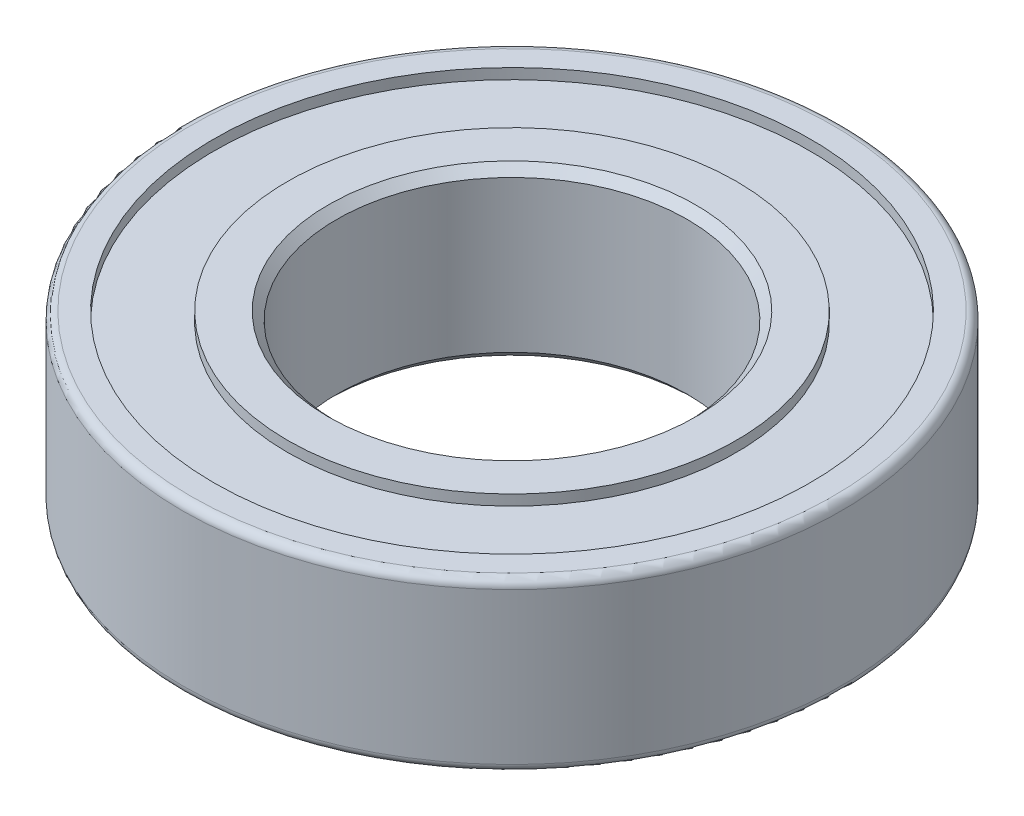
ISO-10303-21;
HEADER;
FILE_DESCRIPTION(('STEP AP214'),'2;1');
FILE_NAME('part.step','',(''),(''),'','','');
FILE_SCHEMA(('AUTOMOTIVE_DESIGN { 1 0 10303 214 1 1 1 1 }'));
ENDSEC;
DATA;
#1=APPLICATION_CONTEXT('core data for automotive mechanical design processes');
#2=APPLICATION_PROTOCOL_DEFINITION('international standard','automotive_design',2000,#1);
#3=PRODUCT_CONTEXT('',#1,'mechanical');
#4=PRODUCT('Part','Part','',(#3));
#5=PRODUCT_RELATED_PRODUCT_CATEGORY('part','',(#4));
#6=PRODUCT_DEFINITION_FORMATION('','',#4);
#7=PRODUCT_DEFINITION_CONTEXT('part definition',#1,'design');
#8=PRODUCT_DEFINITION('design','',#6,#7);
#9=PRODUCT_DEFINITION_SHAPE('','',#8);
#10=(LENGTH_UNIT() NAMED_UNIT(*) SI_UNIT(.MILLI.,.METRE.));
#11=(NAMED_UNIT(*) PLANE_ANGLE_UNIT() SI_UNIT($,.RADIAN.));
#12=(NAMED_UNIT(*) SI_UNIT($,.STERADIAN.) SOLID_ANGLE_UNIT());
#13=UNCERTAINTY_MEASURE_WITH_UNIT(LENGTH_MEASURE(1.E-05),#10,'distance_accuracy_value','');
#14=(GEOMETRIC_REPRESENTATION_CONTEXT(3) GLOBAL_UNCERTAINTY_ASSIGNED_CONTEXT((#13)) GLOBAL_UNIT_ASSIGNED_CONTEXT((#10,
#11,#12)) REPRESENTATION_CONTEXT('',''));
#15=CARTESIAN_POINT('',(0.,0.,0.));
#16=DIRECTION('',(0.,0.,1.));
#17=DIRECTION('',(1.,0.,0.));
#18=AXIS2_PLACEMENT_3D('',#15,#16,#17);
#19=CARTESIAN_POINT('',(0.,-5.4,0.));
#20=DIRECTION('',(0.,1.,0.));
#21=DIRECTION('',(0.,0.,1.));
#22=AXIS2_PLACEMENT_3D('',#19,#20,#21);
#23=TOROIDAL_SURFACE('',#22,22.9,0.6);
#24=CARTESIAN_POINT('',(0.,-6.00000000000001,0.));
#25=DIRECTION('',(0.,1.,0.));
#26=DIRECTION('',(0.,0.,1.));
#27=AXIS2_PLACEMENT_3D('',#24,#25,#26);
#28=CIRCLE('',#27,22.9);
#29=CARTESIAN_POINT('',(0.,-6.,22.9));
#30=VERTEX_POINT('',#29);
#31=EDGE_CURVE('E10',#30,#30,#28,.T.);
#32=ORIENTED_EDGE('',*,*,#31,.T.);
#33=EDGE_LOOP('',(#32));
#34=FACE_BOUND('',#33,.T.);
#35=CARTESIAN_POINT('',(0.,-5.4,0.));
#36=DIRECTION('',(0.,1.,0.));
#37=DIRECTION('',(0.,0.,1.));
#38=AXIS2_PLACEMENT_3D('',#35,#36,#37);
#39=CIRCLE('',#38,23.5);
#40=CARTESIAN_POINT('',(0.,-5.4,23.5));
#41=VERTEX_POINT('',#40);
#42=EDGE_CURVE('E100',#41,#41,#39,.T.);
#43=ORIENTED_EDGE('',*,*,#42,.F.);
#44=EDGE_LOOP('',(#43));
#45=FACE_BOUND('',#44,.T.);
#46=ADVANCED_FACE('F32',(#34,#45),#23,.T.);
#47=CARTESIAN_POINT('',(0.,-6.,22.9));
#48=DIRECTION('',(0.,-1.,0.));
#49=DIRECTION('',(0.,0.,-1.));
#50=AXIS2_PLACEMENT_3D('',#47,#48,#49);
#51=PLANE('',#50);
#52=CARTESIAN_POINT('',(0.,-6.00000000000001,0.));
#53=DIRECTION('',(0.,1.,0.));
#54=DIRECTION('',(0.,0.,1.));
#55=AXIS2_PLACEMENT_3D('',#52,#53,#54);
#56=CIRCLE('',#55,21.25);
#57=CARTESIAN_POINT('',(0.,-6.,21.25));
#58=VERTEX_POINT('',#57);
#59=EDGE_CURVE('E39',#58,#58,#56,.T.);
#60=ORIENTED_EDGE('',*,*,#59,.T.);
#61=EDGE_LOOP('',(#60));
#62=FACE_BOUND('',#61,.T.);
#63=ORIENTED_EDGE('',*,*,#31,.F.);
#64=EDGE_LOOP('',(#63));
#65=FACE_BOUND('',#64,.T.);
#66=ADVANCED_FACE('F108',(#62,#65),#51,.T.);
#67=CARTESIAN_POINT('',(0.,26.6806657171623,0.));
#68=DIRECTION('',(0.,1.,0.));
#69=DIRECTION('',(0.,0.,1.));
#70=AXIS2_PLACEMENT_3D('',#67,#68,#69);
#71=CYLINDRICAL_SURFACE('',#70,21.25);
#72=CARTESIAN_POINT('',(0.,-5.25,0.));
#73=DIRECTION('',(0.,1.,0.));
#74=DIRECTION('',(0.,0.,1.));
#75=AXIS2_PLACEMENT_3D('',#72,#73,#74);
#76=CIRCLE('',#75,21.25);
#77=CARTESIAN_POINT('',(0.,-5.25,21.25));
#78=VERTEX_POINT('',#77);
#79=EDGE_CURVE('E46',#78,#78,#76,.T.);
#80=ORIENTED_EDGE('',*,*,#79,.T.);
#81=EDGE_LOOP('',(#80));
#82=FACE_BOUND('',#81,.T.);
#83=ORIENTED_EDGE('',*,*,#59,.F.);
#84=EDGE_LOOP('',(#83));
#85=FACE_BOUND('',#84,.T.);
#86=ADVANCED_FACE('F112',(#82,#85),#71,.F.);
#87=CARTESIAN_POINT('',(0.,-5.25,21.25));
#88=DIRECTION('',(0.,-1.,0.));
#89=DIRECTION('',(0.,0.,-1.));
#90=AXIS2_PLACEMENT_3D('',#87,#88,#89);
#91=PLANE('',#90);
#92=CARTESIAN_POINT('',(0.,-5.25,0.));
#93=DIRECTION('',(0.,1.,0.));
#94=DIRECTION('',(0.,0.,1.));
#95=AXIS2_PLACEMENT_3D('',#92,#93,#94);
#96=CIRCLE('',#95,16.);
#97=CARTESIAN_POINT('',(0.,-5.25,16.));
#98=VERTEX_POINT('',#97);
#99=EDGE_CURVE('E53',#98,#98,#96,.T.);
#100=ORIENTED_EDGE('',*,*,#99,.T.);
#101=EDGE_LOOP('',(#100));
#102=FACE_BOUND('',#101,.T.);
#103=ORIENTED_EDGE('',*,*,#79,.F.);
#104=EDGE_LOOP('',(#103));
#105=FACE_BOUND('',#104,.T.);
#106=ADVANCED_FACE('F116',(#102,#105),#91,.T.);
#107=CARTESIAN_POINT('',(0.,26.6806657171623,0.));
#108=DIRECTION('',(0.,1.,0.));
#109=DIRECTION('',(0.,0.,1.));
#110=AXIS2_PLACEMENT_3D('',#107,#108,#109);
#111=CYLINDRICAL_SURFACE('',#110,16.);
#112=CARTESIAN_POINT('',(0.,-6.,0.));
#113=DIRECTION('',(0.,1.,0.));
#114=DIRECTION('',(0.,0.,1.));
#115=AXIS2_PLACEMENT_3D('',#112,#113,#114);
#116=CIRCLE('',#115,16.);
#117=CARTESIAN_POINT('',(0.,-6.,16.));
#118=VERTEX_POINT('',#117);
#119=EDGE_CURVE('E59',#118,#118,#116,.T.);
#120=ORIENTED_EDGE('',*,*,#119,.T.);
#121=EDGE_LOOP('',(#120));
#122=FACE_BOUND('',#121,.T.);
#123=ORIENTED_EDGE('',*,*,#99,.F.);
#124=EDGE_LOOP('',(#123));
#125=FACE_BOUND('',#124,.T.);
#126=ADVANCED_FACE('F123',(#122,#125),#111,.T.);
#127=CARTESIAN_POINT('',(0.,-6.,16.));
#128=DIRECTION('',(0.,-1.,0.));
#129=DIRECTION('',(0.,0.,-1.));
#130=AXIS2_PLACEMENT_3D('',#127,#128,#129);
#131=PLANE('',#130);
#132=CARTESIAN_POINT('',(0.,-6.00000000000001,0.));
#133=DIRECTION('',(0.,1.,0.));
#134=DIRECTION('',(0.,0.,1.));
#135=AXIS2_PLACEMENT_3D('',#132,#133,#134);
#136=CIRCLE('',#135,13.1);
#137=CARTESIAN_POINT('',(0.,-6.,13.1));
#138=VERTEX_POINT('',#137);
#139=EDGE_CURVE('E63',#138,#138,#136,.T.);
#140=ORIENTED_EDGE('',*,*,#139,.T.);
#141=EDGE_LOOP('',(#140));
#142=FACE_BOUND('',#141,.T.);
#143=ORIENTED_EDGE('',*,*,#119,.F.);
#144=EDGE_LOOP('',(#143));
#145=FACE_BOUND('',#144,.T.);
#146=ADVANCED_FACE('F127',(#142,#145),#131,.T.);
#147=CARTESIAN_POINT('',(0.,-6.00000000000001,0.));
#148=DIRECTION('',(0.,-1.,0.));
#149=DIRECTION('',(0.,0.,-1.));
#150=AXIS2_PLACEMENT_3D('',#147,#148,#149);
#151=CONICAL_SURFACE('',#150,13.1,0.785398163397447);
#152=CARTESIAN_POINT('',(0.,-5.4,0.));
#153=DIRECTION('',(0.,1.,0.));
#154=DIRECTION('',(0.,0.,1.));
#155=AXIS2_PLACEMENT_3D('',#152,#153,#154);
#156=CIRCLE('',#155,12.5);
#157=CARTESIAN_POINT('',(0.,-5.4,12.5));
#158=VERTEX_POINT('',#157);
#159=EDGE_CURVE('E67',#158,#158,#156,.T.);
#160=ORIENTED_EDGE('',*,*,#159,.T.);
#161=EDGE_LOOP('',(#160));
#162=FACE_BOUND('',#161,.T.);
#163=ORIENTED_EDGE('',*,*,#139,.F.);
#164=EDGE_LOOP('',(#163));
#165=FACE_BOUND('',#164,.T.);
#166=ADVANCED_FACE('F131',(#162,#165),#151,.F.);
#167=CARTESIAN_POINT('',(0.,26.6806657171623,0.));
#168=DIRECTION('',(0.,1.,0.));
#169=DIRECTION('',(0.,0.,1.));
#170=AXIS2_PLACEMENT_3D('',#167,#168,#169);
#171=CYLINDRICAL_SURFACE('',#170,12.5);
#172=CARTESIAN_POINT('',(0.,5.4,0.));
#173=DIRECTION('',(0.,1.,0.));
#174=DIRECTION('',(0.,0.,1.));
#175=AXIS2_PLACEMENT_3D('',#172,#173,#174);
#176=CIRCLE('',#175,12.5);
#177=CARTESIAN_POINT('',(0.,5.4,12.5));
#178=VERTEX_POINT('',#177);
#179=EDGE_CURVE('E71',#178,#178,#176,.T.);
#180=ORIENTED_EDGE('',*,*,#179,.T.);
#181=EDGE_LOOP('',(#180));
#182=FACE_BOUND('',#181,.T.);
#183=ORIENTED_EDGE('',*,*,#159,.F.);
#184=EDGE_LOOP('',(#183));
#185=FACE_BOUND('',#184,.T.);
#186=ADVANCED_FACE('F135',(#182,#185),#171,.F.);
#187=CARTESIAN_POINT('',(0.,5.4,0.));
#188=DIRECTION('',(0.,1.,0.));
#189=DIRECTION('',(0.,0.,1.));
#190=AXIS2_PLACEMENT_3D('',#187,#188,#189);
#191=CONICAL_SURFACE('',#190,12.5,0.785398163397451);
#192=CARTESIAN_POINT('',(0.,5.99999999999999,0.));
#193=DIRECTION('',(0.,1.,0.));
#194=DIRECTION('',(0.,0.,1.));
#195=AXIS2_PLACEMENT_3D('',#192,#193,#194);
#196=CIRCLE('',#195,13.1);
#197=CARTESIAN_POINT('',(0.,6.,13.1));
#198=VERTEX_POINT('',#197);
#199=EDGE_CURVE('E75',#198,#198,#196,.T.);
#200=ORIENTED_EDGE('',*,*,#199,.T.);
#201=EDGE_LOOP('',(#200));
#202=FACE_BOUND('',#201,.T.);
#203=ORIENTED_EDGE('',*,*,#179,.F.);
#204=EDGE_LOOP('',(#203));
#205=FACE_BOUND('',#204,.T.);
#206=ADVANCED_FACE('F139',(#202,#205),#191,.F.);
#207=CARTESIAN_POINT('',(0.,6.,16.));
#208=DIRECTION('',(0.,1.,0.));
#209=DIRECTION('',(0.,0.,1.));
#210=AXIS2_PLACEMENT_3D('',#207,#208,#209);
#211=PLANE('',#210);
#212=CARTESIAN_POINT('',(0.,5.99999999999999,0.));
#213=DIRECTION('',(0.,1.,0.));
#214=DIRECTION('',(0.,0.,1.));
#215=AXIS2_PLACEMENT_3D('',#212,#213,#214);
#216=CIRCLE('',#215,16.);
#217=CARTESIAN_POINT('',(0.,6.,16.));
#218=VERTEX_POINT('',#217);
#219=EDGE_CURVE('E79',#218,#218,#216,.T.);
#220=ORIENTED_EDGE('',*,*,#219,.T.);
#221=EDGE_LOOP('',(#220));
#222=FACE_BOUND('',#221,.T.);
#223=ORIENTED_EDGE('',*,*,#199,.F.);
#224=EDGE_LOOP('',(#223));
#225=FACE_BOUND('',#224,.T.);
#226=ADVANCED_FACE('F143',(#222,#225),#211,.T.);
#227=CARTESIAN_POINT('',(0.,26.6806657171623,0.));
#228=DIRECTION('',(0.,1.,0.));
#229=DIRECTION('',(0.,0.,1.));
#230=AXIS2_PLACEMENT_3D('',#227,#228,#229);
#231=CYLINDRICAL_SURFACE('',#230,16.);
#232=CARTESIAN_POINT('',(0.,5.24999999999999,0.));
#233=DIRECTION('',(0.,1.,0.));
#234=DIRECTION('',(0.,0.,1.));
#235=AXIS2_PLACEMENT_3D('',#232,#233,#234);
#236=CIRCLE('',#235,16.);
#237=CARTESIAN_POINT('',(0.,5.25,16.));
#238=VERTEX_POINT('',#237);
#239=EDGE_CURVE('E83',#238,#238,#236,.T.);
#240=ORIENTED_EDGE('',*,*,#239,.T.);
#241=EDGE_LOOP('',(#240));
#242=FACE_BOUND('',#241,.T.);
#243=ORIENTED_EDGE('',*,*,#219,.F.);
#244=EDGE_LOOP('',(#243));
#245=FACE_BOUND('',#244,.T.);
#246=ADVANCED_FACE('F147',(#242,#245),#231,.T.);
#247=CARTESIAN_POINT('',(0.,5.25,21.25));
#248=DIRECTION('',(0.,1.,0.));
#249=DIRECTION('',(0.,0.,1.));
#250=AXIS2_PLACEMENT_3D('',#247,#248,#249);
#251=PLANE('',#250);
#252=CARTESIAN_POINT('',(0.,5.24999999999999,0.));
#253=DIRECTION('',(0.,1.,0.));
#254=DIRECTION('',(0.,0.,1.));
#255=AXIS2_PLACEMENT_3D('',#252,#253,#254);
#256=CIRCLE('',#255,21.25);
#257=CARTESIAN_POINT('',(0.,5.25,21.25));
#258=VERTEX_POINT('',#257);
#259=EDGE_CURVE('E86',#258,#258,#256,.T.);
#260=ORIENTED_EDGE('',*,*,#259,.T.);
#261=EDGE_LOOP('',(#260));
#262=FACE_BOUND('',#261,.T.);
#263=ORIENTED_EDGE('',*,*,#239,.F.);
#264=EDGE_LOOP('',(#263));
#265=FACE_BOUND('',#264,.T.);
#266=ADVANCED_FACE('F151',(#262,#265),#251,.T.);
#267=CARTESIAN_POINT('',(0.,26.6806657171623,0.));
#268=DIRECTION('',(0.,1.,0.));
#269=DIRECTION('',(0.,0.,1.));
#270=AXIS2_PLACEMENT_3D('',#267,#268,#269);
#271=CYLINDRICAL_SURFACE('',#270,21.25);
#272=CARTESIAN_POINT('',(0.,5.99999999999999,0.));
#273=DIRECTION('',(0.,1.,0.));
#274=DIRECTION('',(0.,0.,1.));
#275=AXIS2_PLACEMENT_3D('',#272,#273,#274);
#276=CIRCLE('',#275,21.25);
#277=CARTESIAN_POINT('',(0.,6.,21.25));
#278=VERTEX_POINT('',#277);
#279=EDGE_CURVE('E90',#278,#278,#276,.T.);
#280=ORIENTED_EDGE('',*,*,#279,.T.);
#281=EDGE_LOOP('',(#280));
#282=FACE_BOUND('',#281,.T.);
#283=ORIENTED_EDGE('',*,*,#259,.F.);
#284=EDGE_LOOP('',(#283));
#285=FACE_BOUND('',#284,.T.);
#286=ADVANCED_FACE('F155',(#282,#285),#271,.F.);
#287=CARTESIAN_POINT('',(0.,6.,22.9));
#288=DIRECTION('',(0.,1.,0.));
#289=DIRECTION('',(0.,0.,1.));
#290=AXIS2_PLACEMENT_3D('',#287,#288,#289);
#291=PLANE('',#290);
#292=CARTESIAN_POINT('',(0.,5.99999999999999,0.));
#293=DIRECTION('',(0.,1.,0.));
#294=DIRECTION('',(0.,0.,1.));
#295=AXIS2_PLACEMENT_3D('',#292,#293,#294);
#296=CIRCLE('',#295,22.9);
#297=CARTESIAN_POINT('',(0.,6.,22.9));
#298=VERTEX_POINT('',#297);
#299=EDGE_CURVE('E93',#298,#298,#296,.T.);
#300=ORIENTED_EDGE('',*,*,#299,.T.);
#301=EDGE_LOOP('',(#300));
#302=FACE_BOUND('',#301,.T.);
#303=ORIENTED_EDGE('',*,*,#279,.F.);
#304=EDGE_LOOP('',(#303));
#305=FACE_BOUND('',#304,.T.);
#306=ADVANCED_FACE('F159',(#302,#305),#291,.T.);
#307=CARTESIAN_POINT('',(0.,5.39999999999999,0.));
#308=DIRECTION('',(0.,1.,0.));
#309=DIRECTION('',(0.,0.,1.));
#310=AXIS2_PLACEMENT_3D('',#307,#308,#309);
#311=TOROIDAL_SURFACE('',#310,22.9,0.6);
#312=CARTESIAN_POINT('',(0.,5.4,0.));
#313=DIRECTION('',(0.,1.,0.));
#314=DIRECTION('',(0.,0.,1.));
#315=AXIS2_PLACEMENT_3D('',#312,#313,#314);
#316=CIRCLE('',#315,23.5);
#317=CARTESIAN_POINT('',(0.,5.4,23.5));
#318=VERTEX_POINT('',#317);
#319=EDGE_CURVE('E97',#318,#318,#316,.T.);
#320=ORIENTED_EDGE('',*,*,#319,.T.);
#321=EDGE_LOOP('',(#320));
#322=FACE_BOUND('',#321,.T.);
#323=ORIENTED_EDGE('',*,*,#299,.F.);
#324=EDGE_LOOP('',(#323));
#325=FACE_BOUND('',#324,.T.);
#326=ADVANCED_FACE('F163',(#322,#325),#311,.T.);
#327=CARTESIAN_POINT('',(0.,26.6806657171623,0.));
#328=DIRECTION('',(0.,1.,0.));
#329=DIRECTION('',(0.,0.,1.));
#330=AXIS2_PLACEMENT_3D('',#327,#328,#329);
#331=CYLINDRICAL_SURFACE('',#330,23.5);
#332=ORIENTED_EDGE('',*,*,#42,.T.);
#333=EDGE_LOOP('',(#332));
#334=FACE_BOUND('',#333,.T.);
#335=ORIENTED_EDGE('',*,*,#319,.F.);
#336=EDGE_LOOP('',(#335));
#337=FACE_BOUND('',#336,.T.);
#338=ADVANCED_FACE('F104',(#334,#337),#331,.T.);
#339=CLOSED_SHELL('',(#46,#66,#86,#106,#126,#146,#166,#186,#206,#226,#246,#266,#286,#306,#326,#338));
#340=MANIFOLD_SOLID_BREP('B2',#339);
#341=ADVANCED_BREP_SHAPE_REPRESENTATION('',(#18,#340),#14);
#342=SHAPE_DEFINITION_REPRESENTATION(#9,#341);
ENDSEC;
END-ISO-10303-21;
